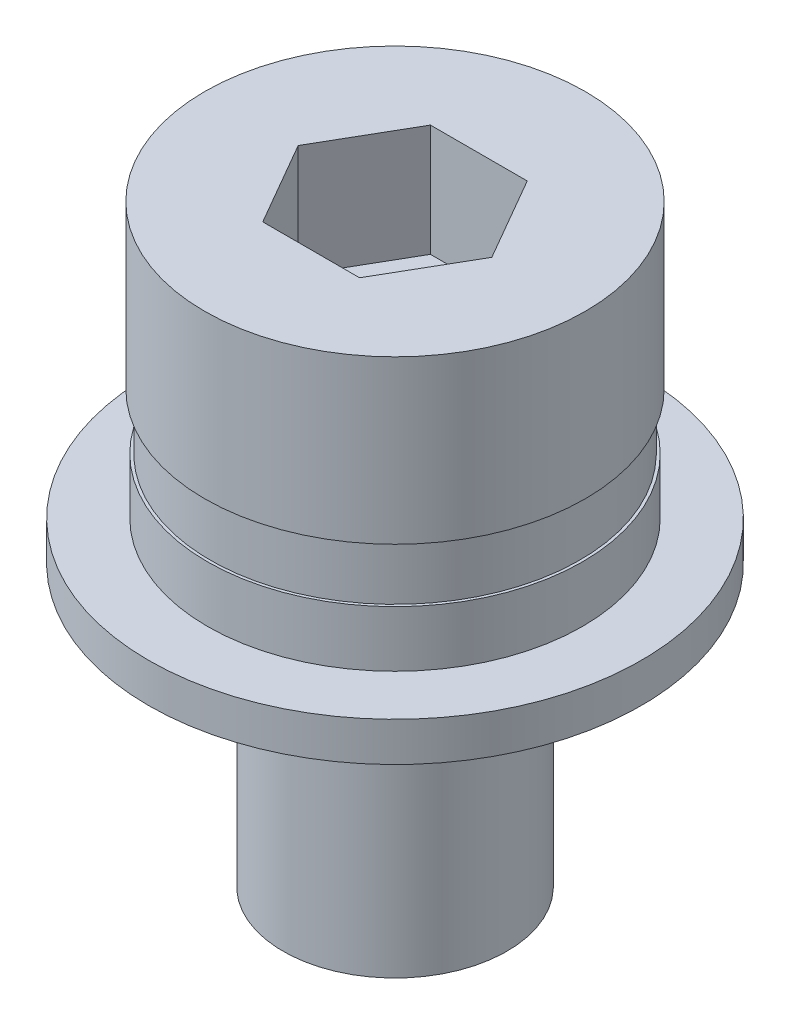
ISO-10303-21;
HEADER;
FILE_DESCRIPTION(('STEP AP214'),'2;1');
FILE_NAME('part.step','',(''),(''),'','','');
FILE_SCHEMA(('AUTOMOTIVE_DESIGN { 1 0 10303 214 1 1 1 1 }'));
ENDSEC;
DATA;
#1=APPLICATION_CONTEXT('core data for automotive mechanical design processes');
#2=APPLICATION_PROTOCOL_DEFINITION('international standard','automotive_design',2000,#1);
#3=PRODUCT_CONTEXT('',#1,'mechanical');
#4=PRODUCT('Part','Part','',(#3));
#5=PRODUCT_RELATED_PRODUCT_CATEGORY('part','',(#4));
#6=PRODUCT_DEFINITION_FORMATION('','',#4);
#7=PRODUCT_DEFINITION_CONTEXT('part definition',#1,'design');
#8=PRODUCT_DEFINITION('design','',#6,#7);
#9=PRODUCT_DEFINITION_SHAPE('','',#8);
#10=(LENGTH_UNIT() NAMED_UNIT(*) SI_UNIT(.MILLI.,.METRE.));
#11=(NAMED_UNIT(*) PLANE_ANGLE_UNIT() SI_UNIT($,.RADIAN.));
#12=(NAMED_UNIT(*) SI_UNIT($,.STERADIAN.) SOLID_ANGLE_UNIT());
#13=UNCERTAINTY_MEASURE_WITH_UNIT(LENGTH_MEASURE(1.E-05),#10,'distance_accuracy_value','');
#14=(GEOMETRIC_REPRESENTATION_CONTEXT(3) GLOBAL_UNCERTAINTY_ASSIGNED_CONTEXT((#13)) GLOBAL_UNIT_ASSIGNED_CONTEXT((#10,
#11,#12)) REPRESENTATION_CONTEXT('',''));
#15=CARTESIAN_POINT('',(0.,0.,0.));
#16=DIRECTION('',(0.,0.,1.));
#17=DIRECTION('',(1.,0.,0.));
#18=AXIS2_PLACEMENT_3D('',#15,#16,#17);
#19=CARTESIAN_POINT('',(0.,0.7,0.));
#20=DIRECTION('',(0.,-1.,0.));
#21=DIRECTION('',(0.,0.,-1.));
#22=AXIS2_PLACEMENT_3D('',#19,#20,#21);
#23=CYLINDRICAL_SURFACE('',#22,4.4);
#24=CARTESIAN_POINT('',(0.,0.7,0.));
#25=DIRECTION('',(0.,1.,0.));
#26=DIRECTION('',(0.,0.,1.));
#27=AXIS2_PLACEMENT_3D('',#24,#25,#26);
#28=CIRCLE('',#27,4.4);
#29=CARTESIAN_POINT('',(0.,0.7,4.4));
#30=VERTEX_POINT('',#29);
#31=EDGE_CURVE('E159',#30,#30,#28,.T.);
#32=ORIENTED_EDGE('',*,*,#31,.F.);
#33=EDGE_LOOP('',(#32));
#34=FACE_BOUND('',#33,.T.);
#35=CARTESIAN_POINT('',(0.,0.,0.));
#36=DIRECTION('',(0.,1.,0.));
#37=DIRECTION('',(0.,0.,1.));
#38=AXIS2_PLACEMENT_3D('',#35,#36,#37);
#39=CIRCLE('',#38,4.4);
#40=CARTESIAN_POINT('',(0.,0.,4.4));
#41=VERTEX_POINT('',#40);
#42=EDGE_CURVE('E156',#41,#41,#39,.T.);
#43=ORIENTED_EDGE('',*,*,#42,.T.);
#44=EDGE_LOOP('',(#43));
#45=FACE_BOUND('',#44,.T.);
#46=ADVANCED_FACE('F35',(#34,#45),#23,.T.);
#47=CARTESIAN_POINT('',(0.,0.7,0.));
#48=DIRECTION('',(0.,1.,0.));
#49=DIRECTION('',(0.,0.,1.));
#50=AXIS2_PLACEMENT_3D('',#47,#48,#49);
#51=PLANE('',#50);
#52=CARTESIAN_POINT('',(0.,0.7,0.));
#53=DIRECTION('',(0.,1.,0.));
#54=DIRECTION('',(0.,0.,1.));
#55=AXIS2_PLACEMENT_3D('',#52,#53,#54);
#56=CIRCLE('',#55,3.35);
#57=CARTESIAN_POINT('',(0.,0.7,3.35));
#58=VERTEX_POINT('',#57);
#59=EDGE_CURVE('E43',#58,#58,#56,.T.);
#60=ORIENTED_EDGE('',*,*,#59,.F.);
#61=EDGE_LOOP('',(#60));
#62=FACE_BOUND('',#61,.T.);
#63=ORIENTED_EDGE('',*,*,#31,.T.);
#64=EDGE_LOOP('',(#63));
#65=FACE_BOUND('',#64,.T.);
#66=ADVANCED_FACE('F168',(#62,#65),#51,.T.);
#67=CARTESIAN_POINT('',(0.,0.,0.));
#68=DIRECTION('',(0.,1.,0.));
#69=DIRECTION('',(0.,0.,1.));
#70=AXIS2_PLACEMENT_3D('',#67,#68,#69);
#71=PLANE('',#70);
#72=CARTESIAN_POINT('',(0.,0.,0.));
#73=DIRECTION('',(0.,-1.,0.));
#74=DIRECTION('',(0.,0.,-1.));
#75=AXIS2_PLACEMENT_3D('',#72,#73,#74);
#76=CIRCLE('',#75,2.);
#77=CARTESIAN_POINT('',(0.,0.,-2.));
#78=VERTEX_POINT('',#77);
#79=EDGE_CURVE('E11',#78,#78,#76,.T.);
#80=ORIENTED_EDGE('',*,*,#79,.F.);
#81=EDGE_LOOP('',(#80));
#82=FACE_BOUND('',#81,.T.);
#83=ORIENTED_EDGE('',*,*,#42,.F.);
#84=EDGE_LOOP('',(#83));
#85=FACE_BOUND('',#84,.T.);
#86=ADVANCED_FACE('F165',(#82,#85),#71,.F.);
#87=CARTESIAN_POINT('',(0.,1.7,0.));
#88=DIRECTION('',(0.,-1.,0.));
#89=DIRECTION('',(0.,0.,-1.));
#90=AXIS2_PLACEMENT_3D('',#87,#88,#89);
#91=CYLINDRICAL_SURFACE('',#90,3.35);
#92=CARTESIAN_POINT('',(0.,1.7,0.));
#93=DIRECTION('',(0.,-1.,0.));
#94=DIRECTION('',(0.,0.,-1.));
#95=AXIS2_PLACEMENT_3D('',#92,#93,#94);
#96=CIRCLE('',#95,3.35);
#97=CARTESIAN_POINT('',(0.,1.7,-3.35));
#98=VERTEX_POINT('',#97);
#99=EDGE_CURVE('E148',#98,#98,#96,.T.);
#100=ORIENTED_EDGE('',*,*,#99,.T.);
#101=EDGE_LOOP('',(#100));
#102=FACE_BOUND('',#101,.T.);
#103=ORIENTED_EDGE('',*,*,#59,.T.);
#104=EDGE_LOOP('',(#103));
#105=FACE_BOUND('',#104,.T.);
#106=ADVANCED_FACE('F167',(#102,#105),#91,.T.);
#107=CARTESIAN_POINT('',(0.,2.7,0.));
#108=DIRECTION('',(0.,-1.,0.));
#109=DIRECTION('',(0.,0.,-1.));
#110=AXIS2_PLACEMENT_3D('',#107,#108,#109);
#111=PLANE('',#110);
#112=CARTESIAN_POINT('',(0.,2.7,0.));
#113=DIRECTION('',(0.,-1.,0.));
#114=DIRECTION('',(0.,0.,-1.));
#115=AXIS2_PLACEMENT_3D('',#112,#113,#114);
#116=CIRCLE('',#115,3.3);
#117=CARTESIAN_POINT('',(0.,2.7,-3.3));
#118=VERTEX_POINT('',#117);
#119=EDGE_CURVE('E145',#118,#118,#116,.T.);
#120=ORIENTED_EDGE('',*,*,#119,.F.);
#121=EDGE_LOOP('',(#120));
#122=FACE_BOUND('',#121,.T.);
#123=CARTESIAN_POINT('',(0.,2.7,0.));
#124=DIRECTION('',(0.,-1.,0.));
#125=DIRECTION('',(0.,0.,-1.));
#126=AXIS2_PLACEMENT_3D('',#123,#124,#125);
#127=CIRCLE('',#126,3.4);
#128=CARTESIAN_POINT('',(0.,2.7,-3.4));
#129=VERTEX_POINT('',#128);
#130=EDGE_CURVE('E38',#129,#129,#127,.T.);
#131=ORIENTED_EDGE('',*,*,#130,.T.);
#132=EDGE_LOOP('',(#131));
#133=FACE_BOUND('',#132,.T.);
#134=ADVANCED_FACE('F174',(#122,#133),#111,.T.);
#135=CARTESIAN_POINT('',(0.,1.7,0.));
#136=DIRECTION('',(0.,-1.,0.));
#137=DIRECTION('',(0.,0.,-1.));
#138=AXIS2_PLACEMENT_3D('',#135,#136,#137);
#139=PLANE('',#138);
#140=CARTESIAN_POINT('',(0.,1.7,0.));
#141=DIRECTION('',(0.,-1.,0.));
#142=DIRECTION('',(0.,0.,-1.));
#143=AXIS2_PLACEMENT_3D('',#140,#141,#142);
#144=CIRCLE('',#143,3.3);
#145=CARTESIAN_POINT('',(0.,1.7,-3.3));
#146=VERTEX_POINT('',#145);
#147=EDGE_CURVE('E139',#146,#146,#144,.T.);
#148=ORIENTED_EDGE('',*,*,#147,.T.);
#149=EDGE_LOOP('',(#148));
#150=FACE_BOUND('',#149,.T.);
#151=ORIENTED_EDGE('',*,*,#99,.F.);
#152=EDGE_LOOP('',(#151));
#153=FACE_BOUND('',#152,.T.);
#154=ADVANCED_FACE('F207',(#150,#153),#139,.F.);
#155=CARTESIAN_POINT('',(0.,2.7,0.));
#156=DIRECTION('',(0.,-1.,0.));
#157=DIRECTION('',(0.,0.,-1.));
#158=AXIS2_PLACEMENT_3D('',#155,#156,#157);
#159=CYLINDRICAL_SURFACE('',#158,3.3);
#160=ORIENTED_EDGE('',*,*,#119,.T.);
#161=EDGE_LOOP('',(#160));
#162=FACE_BOUND('',#161,.T.);
#163=ORIENTED_EDGE('',*,*,#147,.F.);
#164=EDGE_LOOP('',(#163));
#165=FACE_BOUND('',#164,.T.);
#166=ADVANCED_FACE('F218',(#162,#165),#159,.T.);
#167=CARTESIAN_POINT('',(0.,5.6,0.));
#168=DIRECTION('',(0.,1.,0.));
#169=DIRECTION('',(0.,0.,1.));
#170=AXIS2_PLACEMENT_3D('',#167,#168,#169);
#171=PLANE('',#170);
#172=DIRECTION('',(-0.5,0.,0.866025403784439));
#173=VECTOR('',#172,1.);
#174=CARTESIAN_POINT('',(-0.864658064035032,5.6,-1.49763169808282));
#175=LINE('',#174,#173);
#176=CARTESIAN_POINT('',(-0.864658064035032,5.6,-1.49763169808282));
#177=VERTEX_POINT('',#176);
#178=CARTESIAN_POINT('',(-1.72931612807006,5.6,0.));
#179=VERTEX_POINT('',#178);
#180=EDGE_CURVE('E51',#177,#179,#175,.T.);
#181=ORIENTED_EDGE('',*,*,#180,.F.);
#182=DIRECTION('',(-1.,0.,0.));
#183=VECTOR('',#182,1.);
#184=CARTESIAN_POINT('',(0.864658064035031,5.6,-1.49763169808282));
#185=LINE('',#184,#183);
#186=CARTESIAN_POINT('',(0.864658064035031,5.6,-1.49763169808282));
#187=VERTEX_POINT('',#186);
#188=EDGE_CURVE('E135',#187,#177,#185,.T.);
#189=ORIENTED_EDGE('',*,*,#188,.F.);
#190=DIRECTION('',(-0.5,0.,-0.866025403784438));
#191=VECTOR('',#190,1.);
#192=CARTESIAN_POINT('',(1.72931612807006,5.6,0.));
#193=LINE('',#192,#191);
#194=CARTESIAN_POINT('',(1.72931612807006,5.6,0.));
#195=VERTEX_POINT('',#194);
#196=EDGE_CURVE('E133',#195,#187,#193,.T.);
#197=ORIENTED_EDGE('',*,*,#196,.F.);
#198=DIRECTION('',(0.5,0.,-0.866025403784439));
#199=VECTOR('',#198,1.);
#200=CARTESIAN_POINT('',(0.864658064035032,5.6,1.49763169808282));
#201=LINE('',#200,#199);
#202=CARTESIAN_POINT('',(0.864658064035032,5.6,1.49763169808282));
#203=VERTEX_POINT('',#202);
#204=EDGE_CURVE('E99',#203,#195,#201,.T.);
#205=ORIENTED_EDGE('',*,*,#204,.F.);
#206=DIRECTION('',(1.,0.,0.));
#207=VECTOR('',#206,1.);
#208=CARTESIAN_POINT('',(-0.864658064035032,5.6,1.49763169808282));
#209=LINE('',#208,#207);
#210=CARTESIAN_POINT('',(-0.864658064035032,5.6,1.49763169808282));
#211=VERTEX_POINT('',#210);
#212=EDGE_CURVE('E129',#211,#203,#209,.T.);
#213=ORIENTED_EDGE('',*,*,#212,.F.);
#214=DIRECTION('',(0.5,0.,0.866025403784438));
#215=VECTOR('',#214,1.);
#216=CARTESIAN_POINT('',(-1.72931612807006,5.6,0.));
#217=LINE('',#216,#215);
#218=EDGE_CURVE('E125',#179,#211,#217,.T.);
#219=ORIENTED_EDGE('',*,*,#218,.F.);
#220=EDGE_LOOP('',(#181,#189,#197,#205,#213,#219));
#221=FACE_BOUND('',#220,.T.);
#222=CARTESIAN_POINT('',(0.,5.6,0.));
#223=DIRECTION('',(0.,1.,0.));
#224=DIRECTION('',(0.,0.,1.));
#225=AXIS2_PLACEMENT_3D('',#222,#223,#224);
#226=CIRCLE('',#225,3.4);
#227=CARTESIAN_POINT('',(0.,5.6,3.4));
#228=VERTEX_POINT('',#227);
#229=EDGE_CURVE('E153',#228,#228,#226,.T.);
#230=ORIENTED_EDGE('',*,*,#229,.T.);
#231=EDGE_LOOP('',(#230));
#232=FACE_BOUND('',#231,.T.);
#233=ADVANCED_FACE('F228',(#221,#232),#171,.T.);
#234=CARTESIAN_POINT('',(0.,5.6,0.));
#235=DIRECTION('',(0.,-1.,0.));
#236=DIRECTION('',(0.,0.,-1.));
#237=AXIS2_PLACEMENT_3D('',#234,#235,#236);
#238=CYLINDRICAL_SURFACE('',#237,3.4);
#239=ORIENTED_EDGE('',*,*,#229,.F.);
#240=EDGE_LOOP('',(#239));
#241=FACE_BOUND('',#240,.T.);
#242=ORIENTED_EDGE('',*,*,#130,.F.);
#243=EDGE_LOOP('',(#242));
#244=FACE_BOUND('',#243,.T.);
#245=ADVANCED_FACE('F236',(#241,#244),#238,.T.);
#246=CARTESIAN_POINT('',(-0.864658064035032,3.6,-1.49763169808282));
#247=DIRECTION('',(-0.866025403784439,0.,-0.5));
#248=DIRECTION('',(-0.5,0.,0.866025403784439));
#249=AXIS2_PLACEMENT_3D('',#246,#247,#248);
#250=PLANE('',#249);
#251=ORIENTED_EDGE('',*,*,#180,.T.);
#252=DIRECTION('',(0.,1.,0.));
#253=VECTOR('',#252,1.);
#254=CARTESIAN_POINT('',(-1.72931612807006,3.6,0.));
#255=LINE('',#254,#253);
#256=CARTESIAN_POINT('',(-1.72931612807006,3.6,0.));
#257=VERTEX_POINT('',#256);
#258=EDGE_CURVE('E81',#257,#179,#255,.T.);
#259=ORIENTED_EDGE('',*,*,#258,.F.);
#260=DIRECTION('',(-0.5,0.,0.866025403784439));
#261=VECTOR('',#260,1.);
#262=CARTESIAN_POINT('',(-0.864658064035032,3.6,-1.49763169808282));
#263=LINE('',#262,#261);
#264=CARTESIAN_POINT('',(-0.864658064035032,3.6,-1.49763169808282));
#265=VERTEX_POINT('',#264);
#266=EDGE_CURVE('E137',#265,#257,#263,.T.);
#267=ORIENTED_EDGE('',*,*,#266,.F.);
#268=DIRECTION('',(0.,1.,0.));
#269=VECTOR('',#268,1.);
#270=CARTESIAN_POINT('',(-0.864658064035032,3.6,-1.49763169808282));
#271=LINE('',#270,#269);
#272=EDGE_CURVE('E59',#265,#177,#271,.T.);
#273=ORIENTED_EDGE('',*,*,#272,.T.);
#274=EDGE_LOOP('',(#251,#259,#267,#273));
#275=FACE_BOUND('',#274,.T.);
#276=ADVANCED_FACE('F240',(#275),#250,.F.);
#277=CARTESIAN_POINT('',(0.864658064035031,3.6,-1.49763169808282));
#278=DIRECTION('',(0.,0.,-1.));
#279=DIRECTION('',(-1.,0.,0.));
#280=AXIS2_PLACEMENT_3D('',#277,#278,#279);
#281=PLANE('',#280);
#282=ORIENTED_EDGE('',*,*,#188,.T.);
#283=ORIENTED_EDGE('',*,*,#272,.F.);
#284=DIRECTION('',(-1.,0.,0.));
#285=VECTOR('',#284,1.);
#286=CARTESIAN_POINT('',(0.864658064035031,3.6,-1.49763169808282));
#287=LINE('',#286,#285);
#288=CARTESIAN_POINT('',(0.864658064035031,3.6,-1.49763169808282));
#289=VERTEX_POINT('',#288);
#290=EDGE_CURVE('E111',#289,#265,#287,.T.);
#291=ORIENTED_EDGE('',*,*,#290,.F.);
#292=DIRECTION('',(0.,1.,0.));
#293=VECTOR('',#292,1.);
#294=CARTESIAN_POINT('',(0.864658064035031,3.6,-1.49763169808282));
#295=LINE('',#294,#293);
#296=EDGE_CURVE('E103',#289,#187,#295,.T.);
#297=ORIENTED_EDGE('',*,*,#296,.T.);
#298=EDGE_LOOP('',(#282,#283,#291,#297));
#299=FACE_BOUND('',#298,.T.);
#300=ADVANCED_FACE('F256',(#299),#281,.F.);
#301=CARTESIAN_POINT('',(1.72931612807006,3.6,0.));
#302=DIRECTION('',(0.866025403784438,0.,-0.5));
#303=DIRECTION('',(-0.5,0.,-0.866025403784439));
#304=AXIS2_PLACEMENT_3D('',#301,#302,#303);
#305=PLANE('',#304);
#306=ORIENTED_EDGE('',*,*,#196,.T.);
#307=ORIENTED_EDGE('',*,*,#296,.F.);
#308=DIRECTION('',(-0.5,0.,-0.866025403784438));
#309=VECTOR('',#308,1.);
#310=CARTESIAN_POINT('',(1.72931612807006,3.6,0.));
#311=LINE('',#310,#309);
#312=CARTESIAN_POINT('',(1.72931612807006,3.6,0.));
#313=VERTEX_POINT('',#312);
#314=EDGE_CURVE('E107',#313,#289,#311,.T.);
#315=ORIENTED_EDGE('',*,*,#314,.F.);
#316=DIRECTION('',(0.,1.,0.));
#317=VECTOR('',#316,1.);
#318=CARTESIAN_POINT('',(1.72931612807006,3.6,0.));
#319=LINE('',#318,#317);
#320=EDGE_CURVE('E92',#313,#195,#319,.T.);
#321=ORIENTED_EDGE('',*,*,#320,.T.);
#322=EDGE_LOOP('',(#306,#307,#315,#321));
#323=FACE_BOUND('',#322,.T.);
#324=ADVANCED_FACE('F108',(#323),#305,.F.);
#325=CARTESIAN_POINT('',(0.864658064035032,3.6,1.49763169808282));
#326=DIRECTION('',(0.866025403784439,0.,0.5));
#327=DIRECTION('',(0.5,0.,-0.866025403784439));
#328=AXIS2_PLACEMENT_3D('',#325,#326,#327);
#329=PLANE('',#328);
#330=ORIENTED_EDGE('',*,*,#204,.T.);
#331=ORIENTED_EDGE('',*,*,#320,.F.);
#332=DIRECTION('',(0.5,0.,-0.866025403784439));
#333=VECTOR('',#332,1.);
#334=CARTESIAN_POINT('',(0.864658064035032,3.6,1.49763169808282));
#335=LINE('',#334,#333);
#336=CARTESIAN_POINT('',(0.864658064035032,3.6,1.49763169808282));
#337=VERTEX_POINT('',#336);
#338=EDGE_CURVE('E96',#337,#313,#335,.T.);
#339=ORIENTED_EDGE('',*,*,#338,.F.);
#340=DIRECTION('',(0.,1.,0.));
#341=VECTOR('',#340,1.);
#342=CARTESIAN_POINT('',(0.864658064035032,3.6,1.49763169808282));
#343=LINE('',#342,#341);
#344=EDGE_CURVE('E104',#337,#203,#343,.T.);
#345=ORIENTED_EDGE('',*,*,#344,.T.);
#346=EDGE_LOOP('',(#330,#331,#339,#345));
#347=FACE_BOUND('',#346,.T.);
#348=ADVANCED_FACE('F94',(#347),#329,.F.);
#349=CARTESIAN_POINT('',(-0.864658064035032,3.6,1.49763169808282));
#350=DIRECTION('',(0.,0.,1.));
#351=DIRECTION('',(1.,0.,0.));
#352=AXIS2_PLACEMENT_3D('',#349,#350,#351);
#353=PLANE('',#352);
#354=ORIENTED_EDGE('',*,*,#212,.T.);
#355=ORIENTED_EDGE('',*,*,#344,.F.);
#356=DIRECTION('',(1.,0.,0.));
#357=VECTOR('',#356,1.);
#358=CARTESIAN_POINT('',(-0.864658064035032,3.6,1.49763169808282));
#359=LINE('',#358,#357);
#360=CARTESIAN_POINT('',(-0.864658064035032,3.6,1.49763169808282));
#361=VERTEX_POINT('',#360);
#362=EDGE_CURVE('E117',#361,#337,#359,.T.);
#363=ORIENTED_EDGE('',*,*,#362,.F.);
#364=DIRECTION('',(0.,1.,0.));
#365=VECTOR('',#364,1.);
#366=CARTESIAN_POINT('',(-0.864658064035032,3.6,1.49763169808282));
#367=LINE('',#366,#365);
#368=EDGE_CURVE('E142',#361,#211,#367,.T.);
#369=ORIENTED_EDGE('',*,*,#368,.T.);
#370=EDGE_LOOP('',(#354,#355,#363,#369));
#371=FACE_BOUND('',#370,.T.);
#372=ADVANCED_FACE('F281',(#371),#353,.F.);
#373=CARTESIAN_POINT('',(-1.72931612807006,3.6,0.));
#374=DIRECTION('',(-0.866025403784438,0.,0.5));
#375=DIRECTION('',(0.5,0.,0.866025403784439));
#376=AXIS2_PLACEMENT_3D('',#373,#374,#375);
#377=PLANE('',#376);
#378=ORIENTED_EDGE('',*,*,#218,.T.);
#379=ORIENTED_EDGE('',*,*,#368,.F.);
#380=DIRECTION('',(0.5,0.,0.866025403784438));
#381=VECTOR('',#380,1.);
#382=CARTESIAN_POINT('',(-1.72931612807006,3.6,0.));
#383=LINE('',#382,#381);
#384=EDGE_CURVE('E119',#257,#361,#383,.T.);
#385=ORIENTED_EDGE('',*,*,#384,.F.);
#386=ORIENTED_EDGE('',*,*,#258,.T.);
#387=EDGE_LOOP('',(#378,#379,#385,#386));
#388=FACE_BOUND('',#387,.T.);
#389=ADVANCED_FACE('F290',(#388),#377,.F.);
#390=CARTESIAN_POINT('',(0.,3.6,0.));
#391=DIRECTION('',(0.,1.,0.));
#392=DIRECTION('',(0.,0.,1.));
#393=AXIS2_PLACEMENT_3D('',#390,#391,#392);
#394=PLANE('',#393);
#395=ORIENTED_EDGE('',*,*,#266,.T.);
#396=ORIENTED_EDGE('',*,*,#384,.T.);
#397=ORIENTED_EDGE('',*,*,#362,.T.);
#398=ORIENTED_EDGE('',*,*,#338,.T.);
#399=ORIENTED_EDGE('',*,*,#314,.T.);
#400=ORIENTED_EDGE('',*,*,#290,.T.);
#401=EDGE_LOOP('',(#395,#396,#397,#398,#399,#400));
#402=FACE_BOUND('',#401,.T.);
#403=ADVANCED_FACE('F114',(#402),#394,.T.);
#404=CARTESIAN_POINT('',(0.,-5.,0.));
#405=DIRECTION('',(0.,1.,0.));
#406=DIRECTION('',(0.,0.,1.));
#407=AXIS2_PLACEMENT_3D('',#404,#405,#406);
#408=CYLINDRICAL_SURFACE('',#407,2.);
#409=CARTESIAN_POINT('',(0.,-5.,0.));
#410=DIRECTION('',(0.,-1.,0.));
#411=DIRECTION('',(0.,0.,-1.));
#412=AXIS2_PLACEMENT_3D('',#409,#410,#411);
#413=CIRCLE('',#412,2.);
#414=CARTESIAN_POINT('',(0.,-5.,-2.));
#415=VERTEX_POINT('',#414);
#416=EDGE_CURVE('E126',#415,#415,#413,.T.);
#417=ORIENTED_EDGE('',*,*,#416,.F.);
#418=EDGE_LOOP('',(#417));
#419=FACE_BOUND('',#418,.T.);
#420=ORIENTED_EDGE('',*,*,#79,.T.);
#421=EDGE_LOOP('',(#420));
#422=FACE_BOUND('',#421,.T.);
#423=ADVANCED_FACE('F308',(#419,#422),#408,.T.);
#424=CARTESIAN_POINT('',(0.,-5.,0.));
#425=DIRECTION('',(0.,-1.,0.));
#426=DIRECTION('',(0.,0.,-1.));
#427=AXIS2_PLACEMENT_3D('',#424,#425,#426);
#428=PLANE('',#427);
#429=ORIENTED_EDGE('',*,*,#416,.T.);
#430=EDGE_LOOP('',(#429));
#431=FACE_BOUND('',#430,.T.);
#432=ADVANCED_FACE('F321',(#431),#428,.T.);
#433=CLOSED_SHELL('',(#46,#66,#86,#106,#134,#154,#166,#233,#245,#276,#300,#324,#348,#372,#389,
#403,#423,#432));
#434=MANIFOLD_SOLID_BREP('B2',#433);
#435=ADVANCED_BREP_SHAPE_REPRESENTATION('',(#18,#434),#14);
#436=SHAPE_DEFINITION_REPRESENTATION(#9,#435);
ENDSEC;
END-ISO-10303-21;
